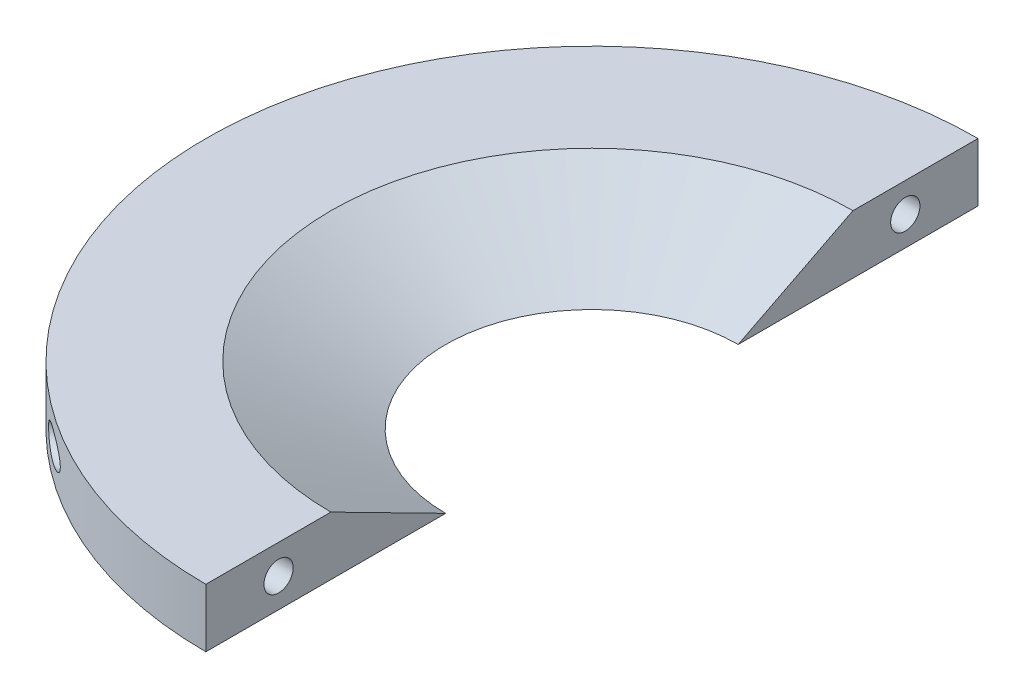
ISO-10303-21;
HEADER;
FILE_DESCRIPTION(('STEP AP214'),'2;1');
FILE_NAME('part.step','',(''),(''),'','','');
FILE_SCHEMA(('AUTOMOTIVE_DESIGN { 1 0 10303 214 1 1 1 1 }'));
ENDSEC;
DATA;
#1=APPLICATION_CONTEXT('core data for automotive mechanical design processes');
#2=APPLICATION_PROTOCOL_DEFINITION('international standard','automotive_design',2000,#1);
#3=PRODUCT_CONTEXT('',#1,'mechanical');
#4=PRODUCT('Part','Part','',(#3));
#5=PRODUCT_RELATED_PRODUCT_CATEGORY('part','',(#4));
#6=PRODUCT_DEFINITION_FORMATION('','',#4);
#7=PRODUCT_DEFINITION_CONTEXT('part definition',#1,'design');
#8=PRODUCT_DEFINITION('design','',#6,#7);
#9=PRODUCT_DEFINITION_SHAPE('','',#8);
#10=(LENGTH_UNIT() NAMED_UNIT(*) SI_UNIT(.MILLI.,.METRE.));
#11=(NAMED_UNIT(*) PLANE_ANGLE_UNIT() SI_UNIT($,.RADIAN.));
#12=(NAMED_UNIT(*) SI_UNIT($,.STERADIAN.) SOLID_ANGLE_UNIT());
#13=UNCERTAINTY_MEASURE_WITH_UNIT(LENGTH_MEASURE(1.E-05),#10,'distance_accuracy_value','');
#14=(GEOMETRIC_REPRESENTATION_CONTEXT(3) GLOBAL_UNCERTAINTY_ASSIGNED_CONTEXT((#13)) GLOBAL_UNIT_ASSIGNED_CONTEXT((#10,
#11,#12)) REPRESENTATION_CONTEXT('',''));
#15=CARTESIAN_POINT('',(0.,0.,0.));
#16=DIRECTION('',(0.,0.,1.));
#17=DIRECTION('',(1.,0.,0.));
#18=AXIS2_PLACEMENT_3D('',#15,#16,#17);
#19=CARTESIAN_POINT('',(0.,6.35,0.));
#20=DIRECTION('',(0.,-1.,0.));
#21=DIRECTION('',(0.,0.,-1.));
#22=AXIS2_PLACEMENT_3D('',#19,#20,#21);
#23=CYLINDRICAL_SURFACE('',#22,83.82);
#24=CARTESIAN_POINT('',(-53.0935487602315,0.,64.8603691019787));
#25=CARTESIAN_POINT('',(-53.0935500286539,0.0662226707414393,64.8603680311481));
#26=CARTESIAN_POINT('',(-53.0910127975436,0.132436803177341,64.8624452355606));
#27=CARTESIAN_POINT('',(-53.0809312956203,0.264252435658818,64.8706958174647));
#28=CARTESIAN_POINT('',(-53.0733850205502,0.329853679811516,64.8768708346041));
#29=CARTESIAN_POINT('',(-53.0534549589577,0.459899219573457,64.8931697601377));
#30=CARTESIAN_POINT('',(-53.0410652091059,0.524341986154317,64.9032985364126));
#31=CARTESIAN_POINT('',(-53.0117380508017,0.651493885020691,64.9272545730836));
#32=CARTESIAN_POINT('',(-52.9947983145883,0.714202111757316,64.9410837265691));
#33=CARTESIAN_POINT('',(-52.9380207837326,0.897913840571192,64.9873889780014));
#34=CARTESIAN_POINT('',(-52.8920118059387,1.0158217851453,65.0248575695322));
#35=CARTESIAN_POINT('',(-52.7865766495619,1.24105539959729,65.1104779166638));
#36=CARTESIAN_POINT('',(-52.7271459825412,1.3483775121057,65.1586332459951));
#37=CARTESIAN_POINT('',(-52.5660334167158,1.60177587215327,65.2887413606845));
#38=CARTESIAN_POINT('',(-52.4578964279814,1.74116228729021,65.3757106410646));
#39=CARTESIAN_POINT('',(-52.2254070806417,1.99652080803118,65.5615856764433));
#40=CARTESIAN_POINT('',(-52.1010145885318,2.11243308984335,65.6605209278731));
#41=CARTESIAN_POINT('',(-51.8703627165283,2.29917869835433,65.8428008714115));
#42=CARTESIAN_POINT('',(-51.7663119118471,2.37428838066193,65.9246516033896));
#43=CARTESIAN_POINT('',(-51.5530347124896,2.51277394258243,66.0915679043502));
#44=CARTESIAN_POINT('',(-51.4438055543614,2.57614346643291,66.1766351848439));
#45=CARTESIAN_POINT('',(-51.2213059547693,2.69213499100825,66.3490018777957));
#46=CARTESIAN_POINT('',(-51.1080313919909,2.74474564155825,66.4363035393396));
#47=CARTESIAN_POINT('',(-50.8784077299176,2.83999375105226,66.612318532623));
#48=CARTESIAN_POINT('',(-50.7620576948927,2.88262813486578,66.7010322906575));
#49=CARTESIAN_POINT('',(-50.4652053574345,2.97860137385989,66.926123523989));
#50=CARTESIAN_POINT('',(-50.2831187606164,3.02579332293789,67.0630518136129));
#51=CARTESIAN_POINT('',(-49.9152292541786,3.10057468454461,67.3373226471313));
#52=CARTESIAN_POINT('',(-49.7294244373659,3.12815375751798,67.4746653712527));
#53=CARTESIAN_POINT('',(-49.3550750797063,3.16508998946102,67.7489699731806));
#54=CARTESIAN_POINT('',(-49.1665250623396,3.17440354043391,67.8859301618919));
#55=CARTESIAN_POINT('',(-48.7883084442665,3.17554094065074,68.1582545454672));
#56=CARTESIAN_POINT('',(-48.5986420877523,3.16736848271156,68.2936190712437));
#57=CARTESIAN_POINT('',(-48.2126523359912,3.13335426174392,68.5666853841256));
#58=CARTESIAN_POINT('',(-48.0163247816722,3.10691327845058,68.7043069523674));
#59=CARTESIAN_POINT('',(-47.6246808249016,3.0356115111939,68.9763657891758));
#60=CARTESIAN_POINT('',(-47.4293648237429,2.99074391091857,69.1108018598887));
#61=CARTESIAN_POINT('',(-47.0420811582356,2.88207479924687,69.3749934227889));
#62=CARTESIAN_POINT('',(-46.8501028289792,2.81835413798846,69.5047663004612));
#63=CARTESIAN_POINT('',(-46.4707034870574,2.67045895338939,69.759000375299));
#64=CARTESIAN_POINT('',(-46.2832783698874,2.58630366523131,69.8834664390139));
#65=CARTESIAN_POINT('',(-45.946880114663,2.41116011645176,70.1049931916373));
#66=CARTESIAN_POINT('',(-45.7967660993457,2.32373649869954,70.2031278872802));
#67=CARTESIAN_POINT('',(-45.5039026542544,2.1305390094311,70.3933069353108));
#68=CARTESIAN_POINT('',(-45.3611666325759,2.02473315471901,70.4853402798527));
#69=CARTESIAN_POINT('',(-45.1553911271703,1.84936464226757,70.6172064576943));
#70=CARTESIAN_POINT('',(-45.0877825942758,1.78768298188154,70.6603869045798));
#71=CARTESIAN_POINT('',(-44.9566079418819,1.65841198314402,70.743917602012));
#72=CARTESIAN_POINT('',(-44.8930430909866,1.59082080646644,70.7842669647816));
#73=CARTESIAN_POINT('',(-44.7104819726506,1.37887654706262,70.8998278563033));
#74=CARTESIAN_POINT('',(-44.5988369499389,1.22471731688048,70.9700522753075));
#75=CARTESIAN_POINT('',(-44.4538939067635,0.967450639480952,71.060871078357));
#76=CARTESIAN_POINT('',(-44.4083246663069,0.874008378554463,71.0893470375893));
#77=CARTESIAN_POINT('',(-44.3298274477481,0.679921343581555,71.1383224203013));
#78=CARTESIAN_POINT('',(-44.2968877282678,0.579283363034723,71.1588292527383));
#79=CARTESIAN_POINT('',(-44.2462895934025,0.371649435204374,71.1903026397643));
#80=CARTESIAN_POINT('',(-44.2287786995021,0.264602344303515,71.2011771003203));
#81=CARTESIAN_POINT('',(-44.211616656228,0.0485421305475453,71.2118351889392));
#82=CARTESIAN_POINT('',(-44.2119538459396,-0.0604696621382317,71.211626058385));
#83=CARTESIAN_POINT('',(-44.229352835259,-0.2641484693863,71.2008203112498));
#84=CARTESIAN_POINT('',(-44.2445302602467,-0.359050445767939,71.1913940569611));
#85=CARTESIAN_POINT('',(-44.2874692518159,-0.544790123671366,71.1646899802333));
#86=CARTESIAN_POINT('',(-44.3152383937254,-0.635625342385935,71.1474074313373));
#87=CARTESIAN_POINT('',(-44.3940190912307,-0.845463002085923,71.0982865055527));
#88=CARTESIAN_POINT('',(-44.4498592664824,-0.961924692659841,71.0634082707643));
#89=CARTESIAN_POINT('',(-44.5763705750667,-1.18295128352989,70.9841189873167));
#90=CARTESIAN_POINT('',(-44.6470765257814,-1.28748734995302,70.9396855535904));
#91=CARTESIAN_POINT('',(-44.7835813936138,-1.46492853852446,70.8535700727452));
#92=CARTESIAN_POINT('',(-44.8474784292243,-1.5399540210035,70.8131504577434));
#93=CARTESIAN_POINT('',(-44.9804320679931,-1.68318605374564,70.728772998542));
#94=CARTESIAN_POINT('',(-45.0494918182209,-1.75138838456941,70.6848129949217));
#95=CARTESIAN_POINT('',(-45.1916595509433,-1.88157360400498,70.5940042410373));
#96=CARTESIAN_POINT('',(-45.2647735531525,-1.94354683801906,70.5471511828113));
#97=CARTESIAN_POINT('',(-45.4141055461373,-2.06169826423978,70.451112938802));
#98=CARTESIAN_POINT('',(-45.4903246422251,-2.1178743672673,70.4019269215197));
#99=CARTESIAN_POINT('',(-45.7038670245801,-2.26543705431757,70.2636119803521));
#100=CARTESIAN_POINT('',(-45.8437371670123,-2.35125718078282,70.172452457701));
#101=CARTESIAN_POINT('',(-46.1285102019459,-2.50842276647231,69.9855844650006));
#102=CARTESIAN_POINT('',(-46.273416655304,-2.57975772987799,69.8898727580188));
#103=CARTESIAN_POINT('',(-46.5669036235328,-2.70944625140465,69.6946698340073));
#104=CARTESIAN_POINT('',(-46.7154909575098,-2.76777334421367,69.5951713852354));
#105=CARTESIAN_POINT('',(-47.0148815648674,-2.87221846062517,69.3932701011263));
#106=CARTESIAN_POINT('',(-47.1656844730096,-2.91833847325352,69.2908677419676));
#107=CARTESIAN_POINT('',(-47.5271799104275,-3.01459499859419,69.0436399314514));
#108=CARTESIAN_POINT('',(-47.738531831872,-3.05941634694042,68.8976895621236));
#109=CARTESIAN_POINT('',(-48.1622545425418,-3.12767822439071,68.6021605207871));
#110=CARTESIAN_POINT('',(-48.3746257703124,-3.151108528018,68.4525801485781));
#111=CARTESIAN_POINT('',(-48.7986447910406,-3.17650004597324,68.1509523403514));
#112=CARTESIAN_POINT('',(-49.0102930343091,-3.17847884308168,67.9989070271295));
#113=CARTESIAN_POINT('',(-49.4314719138549,-3.16023172868848,67.6933496199207));
#114=CARTESIAN_POINT('',(-49.6410036320461,-3.14001780859494,67.5398383624378));
#115=CARTESIAN_POINT('',(-49.9863638029001,-3.08665412104482,67.2843610785158));
#116=CARTESIAN_POINT('',(-50.1232669397173,-3.06014641649399,67.1824330581888));
#117=CARTESIAN_POINT('',(-50.394762941047,-2.99601797456262,66.9790191883565));
#118=CARTESIAN_POINT('',(-50.5293563569208,-2.95839992954019,66.8775332377639));
#119=CARTESIAN_POINT('',(-50.7952810940959,-2.87127167084237,66.6757798829108));
#120=CARTESIAN_POINT('',(-50.9266169298786,-2.82177906201462,66.5755109034641));
#121=CARTESIAN_POINT('',(-51.1851415938316,-2.70984656888521,66.3769556821224));
#122=CARTESIAN_POINT('',(-51.3123321281398,-2.64741209115396,66.2786686310149));
#123=CARTESIAN_POINT('',(-51.5992636682268,-2.48708963481723,66.0556629287136));
#124=CARTESIAN_POINT('',(-51.7571082203123,-2.38419586600768,65.9320201710306));
#125=CARTESIAN_POINT('',(-52.0589427173946,-2.15084282432756,65.6939543484885));
#126=CARTESIAN_POINT('',(-52.2029511946514,-2.02042119340472,65.5795189854845));
#127=CARTESIAN_POINT('',(-52.4320927888345,-1.77002520669556,65.3963544195133));
#128=CARTESIAN_POINT('',(-52.5223519632005,-1.65754569618922,65.3238572186551));
#129=CARTESIAN_POINT('',(-52.6880698537029,-1.41597774490631,65.1902674624514));
#130=CARTESIAN_POINT('',(-52.7635479039375,-1.28691137138408,65.1291600141282));
#131=CARTESIAN_POINT('',(-52.8806312314562,-1.04232032047088,65.0341117503035));
#132=CARTESIAN_POINT('',(-52.9260282361447,-0.929796565965275,64.9971560457529));
#133=CARTESIAN_POINT('',(-53.0017565318533,-0.696687774664222,64.9354188306711));
#134=CARTESIAN_POINT('',(-53.0321193450666,-0.576120211213703,64.9106118491162));
#135=CARTESIAN_POINT('',(-53.0669290481954,-0.378829697077783,64.8821524897982));
#136=CARTESIAN_POINT('',(-53.0768780112493,-0.303671876011927,64.8740124216475));
#137=CARTESIAN_POINT('',(-53.0901879859922,-0.152339109760699,64.8631206498226));
#138=CARTESIAN_POINT('',(-53.0935473013958,-0.0761639077638231,64.8603703335607));
#139=CARTESIAN_POINT('',(-53.0935487602315,0.,64.8603691019787));
#140=B_SPLINE_CURVE_WITH_KNOTS('',3,(#24,#25,#26,#27,#28,#29,#30,#31,#32,#33,#34,#35,#36,#37,
#38,#39,#40,#41,#42,#43,#44,#45,#46,#47,#48,#49,#50,#51,#52,#53,#54,#55,#56,#57,#58,#59,#60,#61,
#62,#63,#64,#65,#66,#67,#68,#69,#70,#71,#72,#73,#74,#75,#76,#77,#78,#79,#80,#81,#82,#83,#84,#85,
#86,#87,#88,#89,#90,#91,#92,#93,#94,#95,#96,#97,#98,#99,#100,#101,#102,#103,#104,#105,#106,#107,
#108,#109,#110,#111,#112,#113,#114,#115,#116,#117,#118,#119,#120,#121,#122,#123,#124,#125,#126,
#127,#128,#129,#130,#131,#132,#133,#134,#135,#136,#137,#138,#139),.UNSPECIFIED.,.T.,.F.,(4,2,2,
2,2,2,2,2,2,2,2,2,2,2,2,2,2,2,2,2,2,2,2,2,2,2,2,2,2,2,2,2,2,2,2,2,2,2,2,2,2,2,2,2,2,2,2,2,2,2,2,
2,2,2,2,2,2,4),(0.,0.198572893905583,0.397225290254361,0.596123043438972,0.795122746643766,
1.1891419938433,1.58329320331309,2.17005112654787,2.75828608788086,3.21430576578742,
3.67057160195664,4.12731632480538,4.58420165183638,5.28116159659883,5.97848869427379,
6.67747860764813,7.3763209180456,8.09924699869623,8.82244074294301,9.54257699219745,
10.2620379848225,10.8597814089248,11.4585754552014,11.7618750097887,12.0652692524857,
12.6687152230024,12.9910940929562,13.3131725236701,13.6382980698692,13.9632112002997,
14.2515989023108,14.5401603324878,14.9392705309598,15.3393261180986,15.65843505295,
15.9777401206475,16.2975326916809,16.6174401105215,17.1797043111437,17.7423744808522,
18.3061792003606,18.8698919967,19.6510879000888,20.4326570402449,21.2135855168348,
21.9940922413111,22.5119501416857,23.0296826528758,23.5466522825908,24.0634063777496,
24.737683777319,25.4110450664863,25.8937804544195,26.375880131284,26.7549479235981,
27.1332175228288,27.3615410822066,27.5899234081757),.UNSPECIFIED.);
#141=CARTESIAN_POINT('',(-53.0935487602315,0.,64.8603691019787));
#142=VERTEX_POINT('',#141);
#143=EDGE_CURVE('E97',#142,#142,#140,.T.);
#144=ORIENTED_EDGE('',*,*,#143,.T.);
#145=EDGE_LOOP('',(#144));
#146=FACE_BOUND('',#145,.T.);
#147=DIRECTION('',(0.,-1.,0.));
#148=VECTOR('',#147,1.);
#149=CARTESIAN_POINT('',(0.,6.35,83.82));
#150=LINE('',#149,#148);
#151=CARTESIAN_POINT('',(0.,6.35,83.82));
#152=VERTEX_POINT('',#151);
#153=CARTESIAN_POINT('',(0.,-6.35,83.82));
#154=VERTEX_POINT('',#153);
#155=EDGE_CURVE('E91',#152,#154,#150,.T.);
#156=ORIENTED_EDGE('',*,*,#155,.F.);
#157=CARTESIAN_POINT('',(0.,6.35,0.));
#158=DIRECTION('',(0.,1.,0.));
#159=DIRECTION('',(0.,0.,1.));
#160=AXIS2_PLACEMENT_3D('',#157,#158,#159);
#161=CIRCLE('',#160,83.82);
#162=CARTESIAN_POINT('',(0.,6.35,-83.82));
#163=VERTEX_POINT('',#162);
#164=EDGE_CURVE('E105',#163,#152,#161,.T.);
#165=ORIENTED_EDGE('',*,*,#164,.F.);
#166=DIRECTION('',(0.,-1.,0.));
#167=VECTOR('',#166,1.);
#168=CARTESIAN_POINT('',(0.,6.35,-83.82));
#169=LINE('',#168,#167);
#170=CARTESIAN_POINT('',(0.,-6.35,-83.82));
#171=VERTEX_POINT('',#170);
#172=EDGE_CURVE('E99',#171,#163,#169,.F.);
#173=ORIENTED_EDGE('',*,*,#172,.F.);
#174=CARTESIAN_POINT('',(0.,-6.35,0.));
#175=DIRECTION('',(0.,1.,0.));
#176=DIRECTION('',(0.,0.,1.));
#177=AXIS2_PLACEMENT_3D('',#174,#175,#176);
#178=CIRCLE('',#177,83.82);
#179=EDGE_CURVE('E55',#171,#154,#178,.T.);
#180=ORIENTED_EDGE('',*,*,#179,.T.);
#181=EDGE_LOOP('',(#156,#165,#173,#180));
#182=FACE_BOUND('',#181,.T.);
#183=CARTESIAN_POINT('',(-44.2139766630412,0.,-71.2103691019787));
#184=CARTESIAN_POINT('',(-44.2139888344073,-0.100467047720612,-71.2103617816572));
#185=CARTESIAN_POINT('',(-44.2217417132204,-0.201031582944794,-71.205549642356));
#186=CARTESIAN_POINT('',(-44.2519695261847,-0.39908357968062,-71.1867676343991));
#187=CARTESIAN_POINT('',(-44.2744700122233,-0.496565392179449,-71.1727818713776));
#188=CARTESIAN_POINT('',(-44.3387401717507,-0.707652345266937,-71.132764865466));
#189=CARTESIAN_POINT('',(-44.3837276775724,-0.819884519214446,-71.1047179865887));
#190=CARTESIAN_POINT('',(-44.4883732786838,-1.03426839612764,-71.0392909326436));
#191=CARTESIAN_POINT('',(-44.5480569290861,-1.13640210059031,-71.0018944978846));
#192=CARTESIAN_POINT('',(-44.7127556406723,-1.38204141902805,-70.8983469017298));
#193=CARTESIAN_POINT('',(-44.8249962194162,-1.51865471976562,-70.8274816387471));
#194=CARTESIAN_POINT('',(-45.0649853319531,-1.77046932273859,-70.6750300612013));
#195=CARTESIAN_POINT('',(-45.1927711199961,-1.88561744374286,-70.5934179515612));
#196=CARTESIAN_POINT('',(-45.441667118152,-2.08425527198141,-70.4334184083164));
#197=CARTESIAN_POINT('',(-45.5616377134755,-2.16990042010017,-70.3558877185874));
#198=CARTESIAN_POINT('',(-45.806889809685,-2.32873243652441,-70.1964576132845));
#199=CARTESIAN_POINT('',(-45.9321751056563,-2.40191020860455,-70.1145550647246));
#200=CARTESIAN_POINT('',(-46.1866408389652,-2.53715226076679,-69.9471932788564));
#201=CARTESIAN_POINT('',(-46.3158276523774,-2.59919705461876,-69.861728121833));
#202=CARTESIAN_POINT('',(-46.5768394025554,-2.71298179351103,-69.6879834774382));
#203=CARTESIAN_POINT('',(-46.7086651016451,-2.7647187121116,-69.5997031723258));
#204=CARTESIAN_POINT('',(-47.0443236662654,-2.88337952709933,-69.3735093528785));
#205=CARTESIAN_POINT('',(-47.2493879126668,-2.94387671362204,-69.2340249712));
#206=CARTESIAN_POINT('',(-47.6617634308876,-3.0438759137925,-68.9507895010614));
#207=CARTESIAN_POINT('',(-47.8690758865444,-3.08336625749292,-68.8070360877404));
#208=CARTESIAN_POINT('',(-48.284381589326,-3.14187657334414,-68.5162402183593));
#209=CARTESIAN_POINT('',(-48.4923750421715,-3.16088964861562,-68.3691966711709));
#210=CARTESIAN_POINT('',(-48.9075155530913,-3.17824540733858,-68.0728456473911));
#211=CARTESIAN_POINT('',(-49.1146629218966,-3.17659652192096,-67.9235391190499));
#212=CARTESIAN_POINT('',(-49.4819876701653,-3.15447917510913,-67.6562275582546));
#213=CARTESIAN_POINT('',(-49.6425985821178,-3.13817429483171,-67.538464379643));
#214=CARTESIAN_POINT('',(-49.9617127876619,-3.09165313778994,-67.302741327471));
#215=CARTESIAN_POINT('',(-50.1202158447545,-3.06143531333278,-67.1847814334826));
#216=CARTESIAN_POINT('',(-50.4337699825244,-2.98616772659455,-66.9497239501303));
#217=CARTESIAN_POINT('',(-50.5888281591867,-2.94115220969682,-66.8326250020702));
#218=CARTESIAN_POINT('',(-50.8945295003287,-2.83496217612211,-66.6001210468855));
#219=CARTESIAN_POINT('',(-51.0451750864308,-2.77379671435408,-66.4847151286713));
#220=CARTESIAN_POINT('',(-51.3671478621066,-2.62091641490012,-66.2363714246917));
#221=CARTESIAN_POINT('',(-51.5372983072902,-2.52567977322248,-66.1040303098099));
#222=CARTESIAN_POINT('',(-51.8650004470516,-2.30674966735852,-65.8472266477411));
#223=CARTESIAN_POINT('',(-52.0225642515419,-2.18308401080936,-65.7227565522867));
#224=CARTESIAN_POINT('',(-52.2808309760676,-1.93880215394647,-65.5173804065751));
#225=CARTESIAN_POINT('',(-52.3858284904835,-1.82534499692298,-65.4334247056476));
#226=CARTESIAN_POINT('',(-52.5806150908431,-1.57899744230848,-65.2770007475825));
#227=CARTESIAN_POINT('',(-52.6704298405729,-1.44614055979623,-65.2045131192652));
#228=CARTESIAN_POINT('',(-52.8090513951842,-1.19684594641786,-65.0922606252002));
#229=CARTESIAN_POINT('',(-52.8624931482691,-1.08465251832155,-65.0488488037341));
#230=CARTESIAN_POINT('',(-52.9545251387869,-0.850529788320753,-64.9739501233196));
#231=CARTESIAN_POINT('',(-52.9931264451395,-0.728607824842068,-64.9424543769082));
#232=CARTESIAN_POINT('',(-53.0528230117337,-0.476559301759938,-64.8936970009146));
#233=CARTESIAN_POINT('',(-53.0737670801338,-0.346371946555549,-64.8765583128375));
#234=CARTESIAN_POINT('',(-53.0955551957821,-0.0832254409532002,-64.8587283575034));
#235=CARTESIAN_POINT('',(-53.0964127564364,0.0497317857102269,-64.8580260325134));
#236=CARTESIAN_POINT('',(-53.0791841011511,0.29629583971401,-64.8721256142562));
#237=CARTESIAN_POINT('',(-53.0635102371026,0.41019989197886,-64.8849531777512));
#238=CARTESIAN_POINT('',(-53.0180643228784,0.633187599793636,-64.9220926205596));
#239=CARTESIAN_POINT('',(-52.9882871014639,0.742269471154572,-64.9464087123319));
#240=CARTESIAN_POINT('',(-52.906586288711,0.98253357568964,-65.012990856968));
#241=CARTESIAN_POINT('',(-52.8508244616036,1.11154483787532,-65.0583541545872));
#242=CARTESIAN_POINT('',(-52.7236186293036,1.35614297382808,-65.1614852176811));
#243=CARTESIAN_POINT('',(-52.6521474026845,1.47170600606165,-65.2192745112374));
#244=CARTESIAN_POINT('',(-52.4644046296102,1.73517208987385,-65.3704715561832));
#245=CARTESIAN_POINT('',(-52.3419983804163,1.8759628481148,-65.4685823956751));
#246=CARTESIAN_POINT('',(-52.0809930225472,2.13146867626622,-65.6764078516739));
#247=CARTESIAN_POINT('',(-51.9423605522705,2.24612854252171,-65.786146329498));
#248=CARTESIAN_POINT('',(-51.6853959507525,2.42976814326398,-65.9881273596684));
#249=CARTESIAN_POINT('',(-51.5691589978988,2.50326403684336,-66.0790199951265));
#250=CARTESIAN_POINT('',(-51.3315644565248,2.63724253003778,-66.2637573391632));
#251=CARTESIAN_POINT('',(-51.2102040943823,2.69771796994989,-66.3576036395651));
#252=CARTESIAN_POINT('',(-50.9635613960224,2.80677687605014,-66.5472166099265));
#253=CARTESIAN_POINT('',(-50.8382757287576,2.8553499155673,-66.6429848846828));
#254=CARTESIAN_POINT('',(-50.5847705471715,2.94148481128432,-66.8356099690463));
#255=CARTESIAN_POINT('',(-50.4565501824085,2.97904343093948,-66.9324670899427));
#256=CARTESIAN_POINT('',(-50.1355627111186,3.05954125179958,-67.1734703191508));
#257=CARTESIAN_POINT('',(-49.9414665576428,3.09635135345272,-67.3179123120261));
#258=CARTESIAN_POINT('',(-49.5501719954765,3.149312868371,-67.6064496768022));
#259=CARTESIAN_POINT('',(-49.3529720878474,3.16545396916918,-67.7505448399006));
#260=CARTESIAN_POINT('',(-48.9562080323834,3.17826374847892,-68.0378004066152));
#261=CARTESIAN_POINT('',(-48.7566379636981,3.17486283143737,-68.180955649358));
#262=CARTESIAN_POINT('',(-48.3571285428435,3.14904074042896,-68.4648856884241));
#263=CARTESIAN_POINT('',(-48.1571893002166,3.12662451347463,-68.6056610941699));
#264=CARTESIAN_POINT('',(-47.7530164895056,3.06198504740474,-68.8876189700268));
#265=CARTESIAN_POINT('',(-47.5488038608893,3.01926993599298,-69.0287197832724));
#266=CARTESIAN_POINT('',(-47.1426717223301,2.91315151693108,-69.3067205489812));
#267=CARTESIAN_POINT('',(-46.9407538573025,2.84973423196363,-69.4436175947099));
#268=CARTESIAN_POINT('',(-46.5426674425188,2.70111468616925,-69.7110429315));
#269=CARTESIAN_POINT('',(-46.3464697851106,2.61605865874637,-69.8416072305891));
#270=CARTESIAN_POINT('',(-46.0580860479289,2.4700379909441,-70.0318385655496));
#271=CARTESIAN_POINT('',(-45.9629994007977,2.41832855400389,-70.0942770360447));
#272=CARTESIAN_POINT('',(-45.7753296164914,2.30824609885606,-70.2169790666809));
#273=CARTESIAN_POINT('',(-45.6827458740285,2.24987470989255,-70.2772431538635));
#274=CARTESIAN_POINT('',(-45.4771152145083,2.10970913937332,-70.4105321190345));
#275=CARTESIAN_POINT('',(-45.3650143916604,2.02577290802828,-70.4827956765065));
#276=CARTESIAN_POINT('',(-45.148009247129,1.84473204357776,-70.6219957082956));
#277=CARTESIAN_POINT('',(-45.0431118920976,1.74761492567417,-70.6889270354227));
#278=CARTESIAN_POINT('',(-44.8430419105905,1.53749052200657,-70.8160161835083));
#279=CARTESIAN_POINT('',(-44.7479726468064,1.42433923733611,-70.876102578415));
#280=CARTESIAN_POINT('',(-44.574311467725,1.18123319231694,-70.9854466895676));
#281=CARTESIAN_POINT('',(-44.4956812863613,1.05131861997748,-71.0347295669844));
#282=CARTESIAN_POINT('',(-44.3855342070679,0.822035984371056,-71.1035826351802));
#283=CARTESIAN_POINT('',(-44.3470926031839,0.727337830428181,-71.1275555497824));
#284=CARTESIAN_POINT('',(-44.2836611520698,0.531942375362184,-71.1670651801898));
#285=CARTESIAN_POINT('',(-44.2586366053947,0.431261304707613,-71.1826236584858));
#286=CARTESIAN_POINT('',(-44.2323908884683,0.274709237254048,-71.1989332910979));
#287=CARTESIAN_POINT('',(-44.2255096606316,0.220100107631763,-71.2032072774659));
#288=CARTESIAN_POINT('',(-44.2162986258051,0.110337212563171,-71.2089275533099));
#289=CARTESIAN_POINT('',(-44.213969977702,0.0551833120322457,-71.2103731227954));
#290=CARTESIAN_POINT('',(-44.2139766630412,0.,-71.2103691019787));
#291=B_SPLINE_CURVE_WITH_KNOTS('',3,(#183,#184,#185,#186,#187,#188,#189,#190,#191,#192,#193,
#194,#195,#196,#197,#198,#199,#200,#201,#202,#203,#204,#205,#206,#207,#208,#209,#210,#211,#212,
#213,#214,#215,#216,#217,#218,#219,#220,#221,#222,#223,#224,#225,#226,#227,#228,#229,#230,#231,
#232,#233,#234,#235,#236,#237,#238,#239,#240,#241,#242,#243,#244,#245,#246,#247,#248,#249,#250,
#251,#252,#253,#254,#255,#256,#257,#258,#259,#260,#261,#262,#263,#264,#265,#266,#267,#268,#269,
#270,#271,#272,#273,#274,#275,#276,#277,#278,#279,#280,#281,#282,#283,#284,#285,#286,#287,#288,
#289,#290),.UNSPECIFIED.,.T.,.F.,(4,2,2,2,2,2,2,2,2,2,2,2,2,2,2,2,2,2,2,2,2,2,2,2,2,2,2,2,2,2,2,
2,2,2,2,2,2,2,2,2,2,2,2,2,2,2,2,2,2,2,2,2,2,4),(0.,0.301176921562078,0.602877050334346,
0.973168309317503,1.34410807183828,1.91236507439402,2.48201177974127,2.98096420590505,
3.48027912423294,3.98045965289164,4.4807868211467,5.24556568084491,6.01076895620008,
6.7762298765553,7.5413784600958,8.14040798964347,8.73950417206935,9.33722355080038,
9.93460851081626,10.6398516356157,11.3444078451583,11.8705357664752,12.395765270488,
12.7892103066338,13.182361315263,13.5788454810162,13.9750629002762,14.3205306588951,
14.6661251873994,15.1067514071164,15.5481472542319,16.1770239341787,16.8072171002837,
17.3010974839766,17.7952487535076,18.2898313712893,18.7845591749723,19.5176939526352,
20.2511943738139,20.9873086465124,21.7232314708404,22.4779743374809,23.2332278352744,
23.9835070063849,24.358192975707,24.7327875075531,25.2048828663775,25.6774285509904,
26.1545242752062,26.630496761411,26.9443294176984,27.2573464703955,27.422731154599,
27.588157932996),.UNSPECIFIED.);
#292=CARTESIAN_POINT('',(-44.2139766630412,0.,-71.2103691019787));
#293=VERTEX_POINT('',#292);
#294=EDGE_CURVE('E38',#293,#293,#291,.T.);
#295=ORIENTED_EDGE('',*,*,#294,.F.);
#296=EDGE_LOOP('',(#295));
#297=FACE_BOUND('',#296,.T.);
#298=ADVANCED_FACE('F34',(#146,#182,#297),#23,.T.);
#299=CARTESIAN_POINT('',(0.,0.,0.));
#300=DIRECTION('',(1.,0.,0.));
#301=DIRECTION('',(0.,0.,-1.));
#302=AXIS2_PLACEMENT_3D('',#299,#300,#301);
#303=PLANE('',#302);
#304=CARTESIAN_POINT('',(0.,0.,-68.0353691019787));
#305=DIRECTION('',(-1.,0.,0.));
#306=DIRECTION('',(0.,0.,1.));
#307=AXIS2_PLACEMENT_3D('',#304,#305,#306);
#308=CIRCLE('',#307,3.175);
#309=CARTESIAN_POINT('',(0.,0.,-64.8603691019787));
#310=VERTEX_POINT('',#309);
#311=EDGE_CURVE('E143',#310,#310,#308,.T.);
#312=ORIENTED_EDGE('',*,*,#311,.T.);
#313=EDGE_LOOP('',(#312));
#314=FACE_BOUND('',#313,.T.);
#315=DIRECTION('',(0.,0.,-1.));
#316=VECTOR('',#315,1.);
#317=CARTESIAN_POINT('',(0.,-6.35,0.));
#318=LINE('',#317,#316);
#319=CARTESIAN_POINT('',(0.,-6.35,-31.75));
#320=VERTEX_POINT('',#319);
#321=EDGE_CURVE('E81',#320,#171,#318,.T.);
#322=ORIENTED_EDGE('',*,*,#321,.T.);
#323=ORIENTED_EDGE('',*,*,#172,.T.);
#324=DIRECTION('',(0.,0.,-1.));
#325=VECTOR('',#324,1.);
#326=CARTESIAN_POINT('',(0.,6.35,0.));
#327=LINE('',#326,#325);
#328=CARTESIAN_POINT('',(0.,6.35,-56.6751534199158));
#329=VERTEX_POINT('',#328);
#330=EDGE_CURVE('E107',#329,#163,#327,.T.);
#331=ORIENTED_EDGE('',*,*,#330,.F.);
#332=DIRECTION('',(0.,0.453990499739541,-0.891006524188371));
#333=VECTOR('',#332,1.);
#334=CARTESIAN_POINT('',(0.,-22.5274330214479,0.));
#335=LINE('',#334,#333);
#336=EDGE_CURVE('E96',#329,#320,#335,.F.);
#337=ORIENTED_EDGE('',*,*,#336,.T.);
#338=EDGE_LOOP('',(#322,#323,#331,#337));
#339=FACE_BOUND('',#338,.T.);
#340=ADVANCED_FACE('F119',(#314,#339),#303,.T.);
#341=CARTESIAN_POINT('',(0.,0.,68.0353691019787));
#342=DIRECTION('',(1.,0.,0.));
#343=DIRECTION('',(0.,0.,-1.));
#344=AXIS2_PLACEMENT_3D('',#341,#342,#343);
#345=CIRCLE('',#344,3.175);
#346=CARTESIAN_POINT('',(0.,0.,64.8603691019787));
#347=VERTEX_POINT('',#346);
#348=EDGE_CURVE('E102',#347,#347,#345,.T.);
#349=ORIENTED_EDGE('',*,*,#348,.F.);
#350=EDGE_LOOP('',(#349));
#351=FACE_BOUND('',#350,.T.);
#352=CARTESIAN_POINT('',(0.,6.35,56.6751534199158));
#353=VERTEX_POINT('',#352);
#354=EDGE_CURVE('E92',#152,#353,#327,.T.);
#355=ORIENTED_EDGE('',*,*,#354,.F.);
#356=ORIENTED_EDGE('',*,*,#155,.T.);
#357=CARTESIAN_POINT('',(0.,-6.35,31.75));
#358=VERTEX_POINT('',#357);
#359=EDGE_CURVE('E79',#154,#358,#318,.T.);
#360=ORIENTED_EDGE('',*,*,#359,.T.);
#361=DIRECTION('',(0.,-0.453990499739541,-0.891006524188371));
#362=VECTOR('',#361,1.);
#363=CARTESIAN_POINT('',(0.,-22.5274330214479,0.));
#364=LINE('',#363,#362);
#365=EDGE_CURVE('E90',#358,#353,#364,.F.);
#366=ORIENTED_EDGE('',*,*,#365,.T.);
#367=EDGE_LOOP('',(#355,#356,#360,#366));
#368=FACE_BOUND('',#367,.T.);
#369=ADVANCED_FACE('F89',(#351,#368),#303,.T.);
#370=CARTESIAN_POINT('',(0.,6.35,0.));
#371=DIRECTION('',(0.,1.,0.));
#372=DIRECTION('',(0.,0.,1.));
#373=AXIS2_PLACEMENT_3D('',#370,#371,#372);
#374=PLANE('',#373);
#375=ORIENTED_EDGE('',*,*,#164,.T.);
#376=ORIENTED_EDGE('',*,*,#354,.T.);
#377=CARTESIAN_POINT('',(0.,6.35,0.));
#378=DIRECTION('',(0.,1.,0.));
#379=DIRECTION('',(0.,0.,1.));
#380=AXIS2_PLACEMENT_3D('',#377,#378,#379);
#381=CIRCLE('',#380,56.6751534199158);
#382=EDGE_CURVE('E47',#329,#353,#381,.T.);
#383=ORIENTED_EDGE('',*,*,#382,.F.);
#384=ORIENTED_EDGE('',*,*,#330,.T.);
#385=EDGE_LOOP('',(#375,#376,#383,#384));
#386=FACE_BOUND('',#385,.T.);
#387=ADVANCED_FACE('F126',(#386),#374,.T.);
#388=CARTESIAN_POINT('',(0.,-6.35,0.));
#389=DIRECTION('',(0.,1.,0.));
#390=DIRECTION('',(0.,0.,1.));
#391=AXIS2_PLACEMENT_3D('',#388,#389,#390);
#392=PLANE('',#391);
#393=ORIENTED_EDGE('',*,*,#359,.F.);
#394=ORIENTED_EDGE('',*,*,#179,.F.);
#395=ORIENTED_EDGE('',*,*,#321,.F.);
#396=CARTESIAN_POINT('',(0.,-6.35,0.));
#397=DIRECTION('',(0.,1.,0.));
#398=DIRECTION('',(0.,0.,1.));
#399=AXIS2_PLACEMENT_3D('',#396,#397,#398);
#400=CIRCLE('',#399,31.75);
#401=EDGE_CURVE('E11',#320,#358,#400,.T.);
#402=ORIENTED_EDGE('',*,*,#401,.T.);
#403=EDGE_LOOP('',(#393,#394,#395,#402));
#404=FACE_BOUND('',#403,.T.);
#405=ADVANCED_FACE('F78',(#404),#392,.F.);
#406=CARTESIAN_POINT('',(0.,6.35,0.));
#407=DIRECTION('',(0.,1.,0.));
#408=DIRECTION('',(0.,0.,1.));
#409=AXIS2_PLACEMENT_3D('',#406,#407,#408);
#410=CONICAL_SURFACE('',#409,56.6751534199158,1.09955742875643);
#411=ORIENTED_EDGE('',*,*,#336,.F.);
#412=ORIENTED_EDGE('',*,*,#382,.T.);
#413=ORIENTED_EDGE('',*,*,#365,.F.);
#414=ORIENTED_EDGE('',*,*,#401,.F.);
#415=EDGE_LOOP('',(#411,#412,#413,#414));
#416=FACE_BOUND('',#415,.T.);
#417=ADVANCED_FACE('F94',(#416),#410,.F.);
#418=CARTESIAN_POINT('',(-60.198,0.,68.0353691019787));
#419=DIRECTION('',(1.,0.,0.));
#420=DIRECTION('',(0.,0.,-1.));
#421=AXIS2_PLACEMENT_3D('',#418,#419,#420);
#422=CYLINDRICAL_SURFACE('',#421,3.175);
#423=ORIENTED_EDGE('',*,*,#348,.T.);
#424=EDGE_LOOP('',(#423));
#425=FACE_BOUND('',#424,.T.);
#426=ORIENTED_EDGE('',*,*,#143,.F.);
#427=EDGE_LOOP('',(#426));
#428=FACE_BOUND('',#427,.T.);
#429=ADVANCED_FACE('F113',(#425,#428),#422,.F.);
#430=CARTESIAN_POINT('',(-60.198,0.,-68.0353691019787));
#431=DIRECTION('',(1.,0.,0.));
#432=DIRECTION('',(0.,0.,-1.));
#433=AXIS2_PLACEMENT_3D('',#430,#431,#432);
#434=CYLINDRICAL_SURFACE('',#433,3.175);
#435=ORIENTED_EDGE('',*,*,#311,.F.);
#436=EDGE_LOOP('',(#435));
#437=FACE_BOUND('',#436,.T.);
#438=ORIENTED_EDGE('',*,*,#294,.T.);
#439=EDGE_LOOP('',(#438));
#440=FACE_BOUND('',#439,.T.);
#441=ADVANCED_FACE('F117',(#437,#440),#434,.F.);
#442=CLOSED_SHELL('',(#298,#340,#369,#387,#405,#417,#429,#441));
#443=MANIFOLD_SOLID_BREP('B2',#442);
#444=ADVANCED_BREP_SHAPE_REPRESENTATION('',(#18,#443),#14);
#445=SHAPE_DEFINITION_REPRESENTATION(#9,#444);
ENDSEC;
END-ISO-10303-21;
